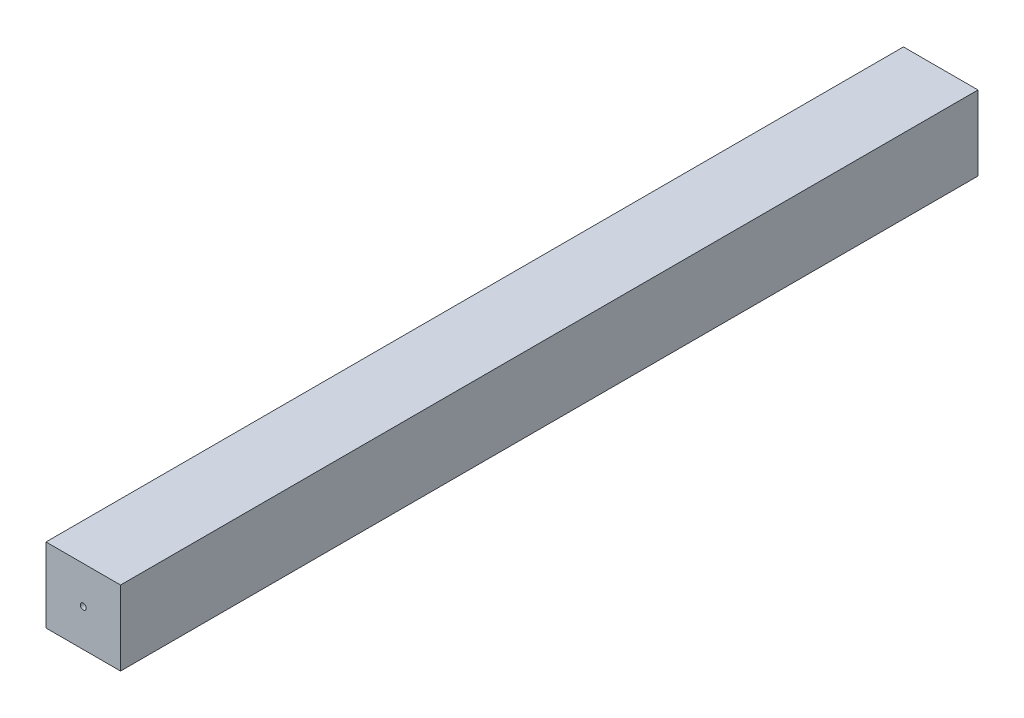
ISO-10303-21;
HEADER;
FILE_DESCRIPTION(('STEP AP214'),'2;1');
FILE_NAME('part.step','',(''),(''),'','','');
FILE_SCHEMA(('AUTOMOTIVE_DESIGN { 1 0 10303 214 1 1 1 1 }'));
ENDSEC;
DATA;
#1=APPLICATION_CONTEXT('core data for automotive mechanical design processes');
#2=APPLICATION_PROTOCOL_DEFINITION('international standard','automotive_design',2000,#1);
#3=PRODUCT_CONTEXT('',#1,'mechanical');
#4=PRODUCT('Part','Part','',(#3));
#5=PRODUCT_RELATED_PRODUCT_CATEGORY('part','',(#4));
#6=PRODUCT_DEFINITION_FORMATION('','',#4);
#7=PRODUCT_DEFINITION_CONTEXT('part definition',#1,'design');
#8=PRODUCT_DEFINITION('design','',#6,#7);
#9=PRODUCT_DEFINITION_SHAPE('','',#8);
#10=(LENGTH_UNIT() NAMED_UNIT(*) SI_UNIT(.MILLI.,.METRE.));
#11=(NAMED_UNIT(*) PLANE_ANGLE_UNIT() SI_UNIT($,.RADIAN.));
#12=(NAMED_UNIT(*) SI_UNIT($,.STERADIAN.) SOLID_ANGLE_UNIT());
#13=UNCERTAINTY_MEASURE_WITH_UNIT(LENGTH_MEASURE(1.E-05),#10,'distance_accuracy_value','');
#14=(GEOMETRIC_REPRESENTATION_CONTEXT(3) GLOBAL_UNCERTAINTY_ASSIGNED_CONTEXT((#13)) GLOBAL_UNIT_ASSIGNED_CONTEXT((#10,
#11,#12)) REPRESENTATION_CONTEXT('',''));
#15=CARTESIAN_POINT('',(0.,0.,0.));
#16=DIRECTION('',(0.,0.,1.));
#17=DIRECTION('',(1.,0.,0.));
#18=AXIS2_PLACEMENT_3D('',#15,#16,#17);
#19=CARTESIAN_POINT('',(-22.,22.,506.));
#20=DIRECTION('',(1.,0.,0.));
#21=DIRECTION('',(0.,1.,0.));
#22=AXIS2_PLACEMENT_3D('',#19,#20,#21);
#23=PLANE('',#22);
#24=DIRECTION('',(0.,-1.,0.));
#25=VECTOR('',#24,1.);
#26=CARTESIAN_POINT('',(-22.,22.,0.));
#27=LINE('',#26,#25);
#28=CARTESIAN_POINT('',(-22.,22.,0.));
#29=VERTEX_POINT('',#28);
#30=CARTESIAN_POINT('',(-22.,-22.,0.));
#31=VERTEX_POINT('',#30);
#32=EDGE_CURVE('E110',#29,#31,#27,.T.);
#33=ORIENTED_EDGE('',*,*,#32,.T.);
#34=DIRECTION('',(0.,0.,-1.));
#35=VECTOR('',#34,1.);
#36=CARTESIAN_POINT('',(-22.,-22.,506.));
#37=LINE('',#36,#35);
#38=CARTESIAN_POINT('',(-22.,-22.,506.));
#39=VERTEX_POINT('',#38);
#40=EDGE_CURVE('E11',#39,#31,#37,.T.);
#41=ORIENTED_EDGE('',*,*,#40,.F.);
#42=DIRECTION('',(0.,-1.,0.));
#43=VECTOR('',#42,1.);
#44=CARTESIAN_POINT('',(-22.,22.,506.));
#45=LINE('',#44,#43);
#46=CARTESIAN_POINT('',(-22.,22.,506.));
#47=VERTEX_POINT('',#46);
#48=EDGE_CURVE('E98',#47,#39,#45,.T.);
#49=ORIENTED_EDGE('',*,*,#48,.F.);
#50=DIRECTION('',(0.,0.,-1.));
#51=VECTOR('',#50,1.);
#52=CARTESIAN_POINT('',(-22.,22.,506.));
#53=LINE('',#52,#51);
#54=EDGE_CURVE('E106',#47,#29,#53,.T.);
#55=ORIENTED_EDGE('',*,*,#54,.T.);
#56=EDGE_LOOP('',(#33,#41,#49,#55));
#57=FACE_BOUND('',#56,.T.);
#58=ADVANCED_FACE('F47',(#57),#23,.F.);
#59=CARTESIAN_POINT('',(22.,-22.,506.));
#60=DIRECTION('',(0.,1.,0.));
#61=DIRECTION('',(-1.,0.,0.));
#62=AXIS2_PLACEMENT_3D('',#59,#60,#61);
#63=PLANE('',#62);
#64=DIRECTION('',(1.,0.,0.));
#65=VECTOR('',#64,1.);
#66=CARTESIAN_POINT('',(22.,-22.,0.));
#67=LINE('',#66,#65);
#68=CARTESIAN_POINT('',(22.,-22.,0.));
#69=VERTEX_POINT('',#68);
#70=EDGE_CURVE('E102',#31,#69,#67,.T.);
#71=ORIENTED_EDGE('',*,*,#70,.T.);
#72=DIRECTION('',(0.,0.,-1.));
#73=VECTOR('',#72,1.);
#74=CARTESIAN_POINT('',(22.,-22.,506.));
#75=LINE('',#74,#73);
#76=CARTESIAN_POINT('',(22.,-22.,506.));
#77=VERTEX_POINT('',#76);
#78=EDGE_CURVE('E55',#77,#69,#75,.T.);
#79=ORIENTED_EDGE('',*,*,#78,.F.);
#80=DIRECTION('',(1.,0.,0.));
#81=VECTOR('',#80,1.);
#82=CARTESIAN_POINT('',(22.,-22.,506.));
#83=LINE('',#82,#81);
#84=EDGE_CURVE('E93',#39,#77,#83,.T.);
#85=ORIENTED_EDGE('',*,*,#84,.F.);
#86=ORIENTED_EDGE('',*,*,#40,.T.);
#87=EDGE_LOOP('',(#71,#79,#85,#86));
#88=FACE_BOUND('',#87,.T.);
#89=ADVANCED_FACE('F101',(#88),#63,.F.);
#90=CARTESIAN_POINT('',(22.,22.,506.));
#91=DIRECTION('',(-1.,0.,0.));
#92=DIRECTION('',(0.,-1.,0.));
#93=AXIS2_PLACEMENT_3D('',#90,#91,#92);
#94=PLANE('',#93);
#95=DIRECTION('',(0.,1.,0.));
#96=VECTOR('',#95,1.);
#97=CARTESIAN_POINT('',(22.,22.,0.));
#98=LINE('',#97,#96);
#99=CARTESIAN_POINT('',(22.,22.,0.));
#100=VERTEX_POINT('',#99);
#101=EDGE_CURVE('E80',#69,#100,#98,.T.);
#102=ORIENTED_EDGE('',*,*,#101,.T.);
#103=DIRECTION('',(0.,0.,-1.));
#104=VECTOR('',#103,1.);
#105=CARTESIAN_POINT('',(22.,22.,506.));
#106=LINE('',#105,#104);
#107=CARTESIAN_POINT('',(22.,22.,506.));
#108=VERTEX_POINT('',#107);
#109=EDGE_CURVE('E103',#108,#100,#106,.T.);
#110=ORIENTED_EDGE('',*,*,#109,.F.);
#111=DIRECTION('',(0.,1.,0.));
#112=VECTOR('',#111,1.);
#113=CARTESIAN_POINT('',(22.,22.,506.));
#114=LINE('',#113,#112);
#115=EDGE_CURVE('E96',#77,#108,#114,.T.);
#116=ORIENTED_EDGE('',*,*,#115,.F.);
#117=ORIENTED_EDGE('',*,*,#78,.T.);
#118=EDGE_LOOP('',(#102,#110,#116,#117));
#119=FACE_BOUND('',#118,.T.);
#120=ADVANCED_FACE('F104',(#119),#94,.F.);
#121=CARTESIAN_POINT('',(22.,22.,506.));
#122=DIRECTION('',(0.,-1.,0.));
#123=DIRECTION('',(1.,0.,0.));
#124=AXIS2_PLACEMENT_3D('',#121,#122,#123);
#125=PLANE('',#124);
#126=DIRECTION('',(-1.,0.,0.));
#127=VECTOR('',#126,1.);
#128=CARTESIAN_POINT('',(22.,22.,0.));
#129=LINE('',#128,#127);
#130=EDGE_CURVE('E86',#100,#29,#129,.T.);
#131=ORIENTED_EDGE('',*,*,#130,.T.);
#132=ORIENTED_EDGE('',*,*,#54,.F.);
#133=DIRECTION('',(-1.,0.,0.));
#134=VECTOR('',#133,1.);
#135=CARTESIAN_POINT('',(22.,22.,506.));
#136=LINE('',#135,#134);
#137=EDGE_CURVE('E63',#108,#47,#136,.T.);
#138=ORIENTED_EDGE('',*,*,#137,.F.);
#139=ORIENTED_EDGE('',*,*,#109,.T.);
#140=EDGE_LOOP('',(#131,#132,#138,#139));
#141=FACE_BOUND('',#140,.T.);
#142=ADVANCED_FACE('F118',(#141),#125,.F.);
#143=CARTESIAN_POINT('',(0.,0.,506.));
#144=DIRECTION('',(0.,0.,-1.));
#145=DIRECTION('',(-1.,0.,0.));
#146=AXIS2_PLACEMENT_3D('',#143,#144,#145);
#147=PLANE('',#146);
#148=CARTESIAN_POINT('',(0.,0.,506.));
#149=DIRECTION('',(0.,0.,1.));
#150=DIRECTION('',(1.,0.,0.));
#151=AXIS2_PLACEMENT_3D('',#148,#149,#150);
#152=CIRCLE('',#151,1.75);
#153=CARTESIAN_POINT('',(1.75,0.,506.));
#154=VERTEX_POINT('',#153);
#155=EDGE_CURVE('E130',#154,#154,#152,.T.);
#156=ORIENTED_EDGE('',*,*,#155,.F.);
#157=EDGE_LOOP('',(#156));
#158=FACE_BOUND('',#157,.T.);
#159=ORIENTED_EDGE('',*,*,#48,.T.);
#160=ORIENTED_EDGE('',*,*,#84,.T.);
#161=ORIENTED_EDGE('',*,*,#115,.T.);
#162=ORIENTED_EDGE('',*,*,#137,.T.);
#163=EDGE_LOOP('',(#159,#160,#161,#162));
#164=FACE_BOUND('',#163,.T.);
#165=ADVANCED_FACE('F94',(#158,#164),#147,.F.);
#166=CARTESIAN_POINT('',(0.,0.,0.));
#167=DIRECTION('',(0.,0.,-1.));
#168=DIRECTION('',(-1.,0.,0.));
#169=AXIS2_PLACEMENT_3D('',#166,#167,#168);
#170=PLANE('',#169);
#171=CARTESIAN_POINT('',(0.,0.,0.));
#172=DIRECTION('',(0.,0.,-1.));
#173=DIRECTION('',(-1.,0.,0.));
#174=AXIS2_PLACEMENT_3D('',#171,#172,#173);
#175=CIRCLE('',#174,1.75);
#176=CARTESIAN_POINT('',(-1.75,0.,0.));
#177=VERTEX_POINT('',#176);
#178=EDGE_CURVE('E124',#177,#177,#175,.T.);
#179=ORIENTED_EDGE('',*,*,#178,.F.);
#180=EDGE_LOOP('',(#179));
#181=FACE_BOUND('',#180,.T.);
#182=ORIENTED_EDGE('',*,*,#32,.F.);
#183=ORIENTED_EDGE('',*,*,#130,.F.);
#184=ORIENTED_EDGE('',*,*,#101,.F.);
#185=ORIENTED_EDGE('',*,*,#70,.F.);
#186=EDGE_LOOP('',(#182,#183,#184,#185));
#187=FACE_BOUND('',#186,.T.);
#188=ADVANCED_FACE('F121',(#181,#187),#170,.T.);
#189=CARTESIAN_POINT('',(0.,0.,60.));
#190=DIRECTION('',(0.,0.,-1.));
#191=DIRECTION('',(-1.,0.,0.));
#192=AXIS2_PLACEMENT_3D('',#189,#190,#191);
#193=CYLINDRICAL_SURFACE('',#192,1.75);
#194=CARTESIAN_POINT('',(0.,0.,60.));
#195=DIRECTION('',(0.,0.,-1.));
#196=DIRECTION('',(-1.,0.,0.));
#197=AXIS2_PLACEMENT_3D('',#194,#195,#196);
#198=CIRCLE('',#197,1.75);
#199=CARTESIAN_POINT('',(-1.75,0.,60.));
#200=VERTEX_POINT('',#199);
#201=EDGE_CURVE('E113',#200,#200,#198,.T.);
#202=ORIENTED_EDGE('',*,*,#201,.F.);
#203=EDGE_LOOP('',(#202));
#204=FACE_BOUND('',#203,.T.);
#205=ORIENTED_EDGE('',*,*,#178,.T.);
#206=EDGE_LOOP('',(#205));
#207=FACE_BOUND('',#206,.T.);
#208=ADVANCED_FACE('F150',(#204,#207),#193,.F.);
#209=CARTESIAN_POINT('',(0.,0.,60.));
#210=DIRECTION('',(0.,0.,-1.));
#211=DIRECTION('',(-1.,0.,0.));
#212=AXIS2_PLACEMENT_3D('',#209,#210,#211);
#213=PLANE('',#212);
#214=ORIENTED_EDGE('',*,*,#201,.T.);
#215=EDGE_LOOP('',(#214));
#216=FACE_BOUND('',#215,.T.);
#217=ADVANCED_FACE('F141',(#216),#213,.T.);
#218=CARTESIAN_POINT('',(0.,0.,446.));
#219=DIRECTION('',(0.,0.,1.));
#220=DIRECTION('',(1.,0.,0.));
#221=AXIS2_PLACEMENT_3D('',#218,#219,#220);
#222=CYLINDRICAL_SURFACE('',#221,1.75);
#223=CARTESIAN_POINT('',(0.,0.,446.));
#224=DIRECTION('',(0.,0.,1.));
#225=DIRECTION('',(1.,0.,0.));
#226=AXIS2_PLACEMENT_3D('',#223,#224,#225);
#227=CIRCLE('',#226,1.75);
#228=CARTESIAN_POINT('',(1.75,0.,446.));
#229=VERTEX_POINT('',#228);
#230=EDGE_CURVE('E127',#229,#229,#227,.T.);
#231=ORIENTED_EDGE('',*,*,#230,.F.);
#232=EDGE_LOOP('',(#231));
#233=FACE_BOUND('',#232,.T.);
#234=ORIENTED_EDGE('',*,*,#155,.T.);
#235=EDGE_LOOP('',(#234));
#236=FACE_BOUND('',#235,.T.);
#237=ADVANCED_FACE('F138',(#233,#236),#222,.F.);
#238=CARTESIAN_POINT('',(0.,0.,446.));
#239=DIRECTION('',(0.,0.,1.));
#240=DIRECTION('',(1.,0.,0.));
#241=AXIS2_PLACEMENT_3D('',#238,#239,#240);
#242=PLANE('',#241);
#243=ORIENTED_EDGE('',*,*,#230,.T.);
#244=EDGE_LOOP('',(#243));
#245=FACE_BOUND('',#244,.T.);
#246=ADVANCED_FACE('F136',(#245),#242,.T.);
#247=CLOSED_SHELL('',(#58,#89,#120,#142,#165,#188,#208,#217,#237,#246));
#248=MANIFOLD_SOLID_BREP('B2',#247);
#249=ADVANCED_BREP_SHAPE_REPRESENTATION('',(#18,#248),#14);
#250=SHAPE_DEFINITION_REPRESENTATION(#9,#249);
ENDSEC;
END-ISO-10303-21;
